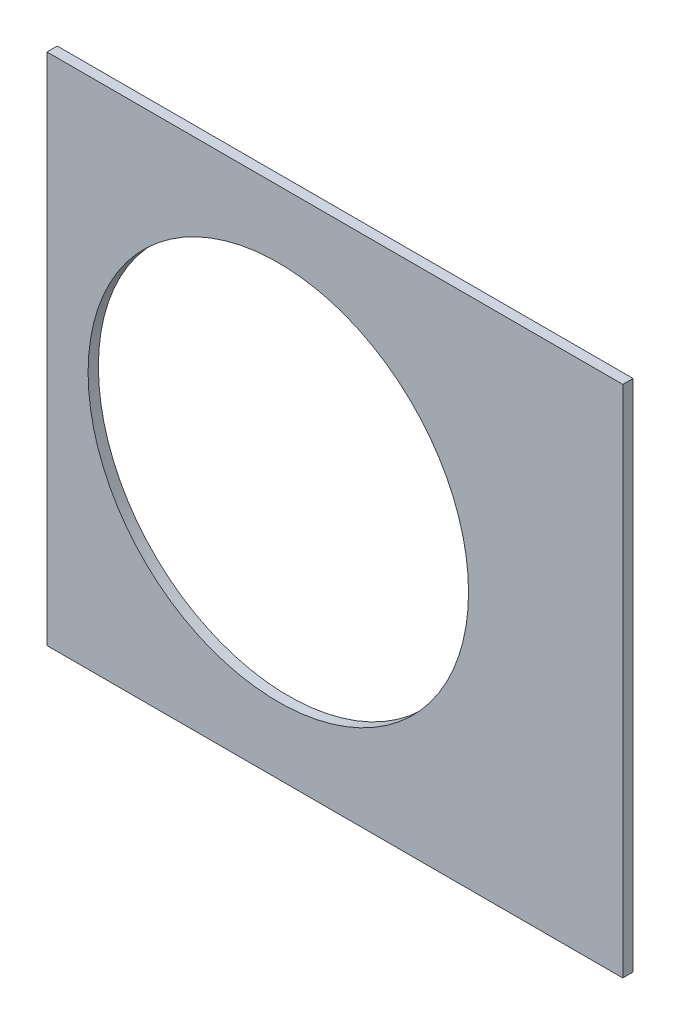
ISO-10303-21;
HEADER;
FILE_DESCRIPTION(('STEP AP214'),'2;1');
FILE_NAME('part.step','',(''),(''),'','','');
FILE_SCHEMA(('AUTOMOTIVE_DESIGN { 1 0 10303 214 1 1 1 1 }'));
ENDSEC;
DATA;
#1=APPLICATION_CONTEXT('core data for automotive mechanical design processes');
#2=APPLICATION_PROTOCOL_DEFINITION('international standard','automotive_design',2000,#1);
#3=PRODUCT_CONTEXT('',#1,'mechanical');
#4=PRODUCT('Part','Part','',(#3));
#5=PRODUCT_RELATED_PRODUCT_CATEGORY('part','',(#4));
#6=PRODUCT_DEFINITION_FORMATION('','',#4);
#7=PRODUCT_DEFINITION_CONTEXT('part definition',#1,'design');
#8=PRODUCT_DEFINITION('design','',#6,#7);
#9=PRODUCT_DEFINITION_SHAPE('','',#8);
#10=(LENGTH_UNIT() NAMED_UNIT(*) SI_UNIT(.MILLI.,.METRE.));
#11=(NAMED_UNIT(*) PLANE_ANGLE_UNIT() SI_UNIT($,.RADIAN.));
#12=(NAMED_UNIT(*) SI_UNIT($,.STERADIAN.) SOLID_ANGLE_UNIT());
#13=UNCERTAINTY_MEASURE_WITH_UNIT(LENGTH_MEASURE(1.E-05),#10,'distance_accuracy_value','');
#14=(GEOMETRIC_REPRESENTATION_CONTEXT(3) GLOBAL_UNCERTAINTY_ASSIGNED_CONTEXT((#13)) GLOBAL_UNIT_ASSIGNED_CONTEXT((#10,
#11,#12)) REPRESENTATION_CONTEXT('',''));
#15=CARTESIAN_POINT('',(0.,0.,0.));
#16=DIRECTION('',(0.,0.,1.));
#17=DIRECTION('',(1.,0.,0.));
#18=AXIS2_PLACEMENT_3D('',#15,#16,#17);
#19=CARTESIAN_POINT('',(0.,0.,0.254));
#20=DIRECTION('',(0.,0.,-1.));
#21=DIRECTION('',(-1.,0.,0.));
#22=AXIS2_PLACEMENT_3D('',#19,#20,#21);
#23=PLANE('',#22);
#24=CARTESIAN_POINT('',(75.692,0.,0.254));
#25=DIRECTION('',(0.,0.,1.));
#26=DIRECTION('',(1.,0.,0.));
#27=AXIS2_PLACEMENT_3D('',#24,#25,#26);
#28=CIRCLE('',#27,4.69899999999999);
#29=CARTESIAN_POINT('',(80.391,0.,0.254));
#30=VERTEX_POINT('',#29);
#31=EDGE_CURVE('E97',#30,#30,#28,.T.);
#32=ORIENTED_EDGE('',*,*,#31,.F.);
#33=EDGE_LOOP('',(#32));
#34=FACE_BOUND('',#33,.T.);
#35=DIRECTION('',(1.,0.,0.));
#36=VECTOR('',#35,1.);
#37=CARTESIAN_POINT('',(88.6729242779328,6.35,0.254));
#38=LINE('',#37,#36);
#39=CARTESIAN_POINT('',(69.977,6.35,0.254));
#40=VERTEX_POINT('',#39);
#41=CARTESIAN_POINT('',(84.201,6.35,0.254));
#42=VERTEX_POINT('',#41);
#43=EDGE_CURVE('E85',#40,#42,#38,.T.);
#44=ORIENTED_EDGE('',*,*,#43,.F.);
#45=DIRECTION('',(0.,1.,0.));
#46=VECTOR('',#45,1.);
#47=CARTESIAN_POINT('',(69.977,-6.35000000000001,0.254));
#48=LINE('',#47,#46);
#49=CARTESIAN_POINT('',(69.977,-6.35000000000001,0.254));
#50=VERTEX_POINT('',#49);
#51=EDGE_CURVE('E71',#50,#40,#48,.T.);
#52=ORIENTED_EDGE('',*,*,#51,.F.);
#53=DIRECTION('',(1.,0.,0.));
#54=VECTOR('',#53,1.);
#55=CARTESIAN_POINT('',(101.401368333963,-6.35,0.254));
#56=LINE('',#55,#54);
#57=CARTESIAN_POINT('',(84.201,-6.35000000000001,0.254));
#58=VERTEX_POINT('',#57);
#59=EDGE_CURVE('E12',#50,#58,#56,.T.);
#60=ORIENTED_EDGE('',*,*,#59,.T.);
#61=DIRECTION('',(0.,-1.,0.));
#62=VECTOR('',#61,1.);
#63=CARTESIAN_POINT('',(84.201,-6.35000000000001,0.254));
#64=LINE('',#63,#62);
#65=EDGE_CURVE('E88',#42,#58,#64,.T.);
#66=ORIENTED_EDGE('',*,*,#65,.F.);
#67=EDGE_LOOP('',(#44,#52,#60,#66));
#68=FACE_BOUND('',#67,.T.);
#69=ADVANCED_FACE('F35',(#34,#68),#23,.F.);
#70=CARTESIAN_POINT('',(0.,0.,0.));
#71=DIRECTION('',(0.,0.,-1.));
#72=DIRECTION('',(-1.,0.,0.));
#73=AXIS2_PLACEMENT_3D('',#70,#71,#72);
#74=PLANE('',#73);
#75=CARTESIAN_POINT('',(75.692,0.,0.));
#76=DIRECTION('',(0.,0.,1.));
#77=DIRECTION('',(1.,0.,0.));
#78=AXIS2_PLACEMENT_3D('',#75,#76,#77);
#79=CIRCLE('',#78,4.69899999999999);
#80=CARTESIAN_POINT('',(80.391,0.,0.));
#81=VERTEX_POINT('',#80);
#82=EDGE_CURVE('E94',#81,#81,#79,.T.);
#83=ORIENTED_EDGE('',*,*,#82,.T.);
#84=EDGE_LOOP('',(#83));
#85=FACE_BOUND('',#84,.T.);
#86=DIRECTION('',(0.,1.,0.));
#87=VECTOR('',#86,1.);
#88=CARTESIAN_POINT('',(69.977,-6.35000000000001,0.));
#89=LINE('',#88,#87);
#90=CARTESIAN_POINT('',(69.977,-6.35,0.));
#91=VERTEX_POINT('',#90);
#92=CARTESIAN_POINT('',(69.977,6.35,0.));
#93=VERTEX_POINT('',#92);
#94=EDGE_CURVE('E50',#91,#93,#89,.T.);
#95=ORIENTED_EDGE('',*,*,#94,.T.);
#96=DIRECTION('',(1.,0.,0.));
#97=VECTOR('',#96,1.);
#98=CARTESIAN_POINT('',(88.6729242779328,6.35,0.));
#99=LINE('',#98,#97);
#100=CARTESIAN_POINT('',(84.201,6.35,0.));
#101=VERTEX_POINT('',#100);
#102=EDGE_CURVE('E87',#93,#101,#99,.T.);
#103=ORIENTED_EDGE('',*,*,#102,.T.);
#104=DIRECTION('',(0.,-1.,0.));
#105=VECTOR('',#104,1.);
#106=CARTESIAN_POINT('',(84.201,-6.35000000000001,0.));
#107=LINE('',#106,#105);
#108=CARTESIAN_POINT('',(84.201,-6.35000000000001,0.));
#109=VERTEX_POINT('',#108);
#110=EDGE_CURVE('E106',#101,#109,#107,.T.);
#111=ORIENTED_EDGE('',*,*,#110,.T.);
#112=DIRECTION('',(1.,0.,0.));
#113=VECTOR('',#112,1.);
#114=CARTESIAN_POINT('',(101.401368333963,-6.35,0.));
#115=LINE('',#114,#113);
#116=EDGE_CURVE('E39',#91,#109,#115,.T.);
#117=ORIENTED_EDGE('',*,*,#116,.F.);
#118=EDGE_LOOP('',(#95,#103,#111,#117));
#119=FACE_BOUND('',#118,.T.);
#120=ADVANCED_FACE('F112',(#85,#119),#74,.T.);
#121=CARTESIAN_POINT('',(88.6729242779328,6.35,0.254));
#122=DIRECTION('',(0.,1.,0.));
#123=DIRECTION('',(-1.,0.,0.));
#124=AXIS2_PLACEMENT_3D('',#121,#122,#123);
#125=PLANE('',#124);
#126=ORIENTED_EDGE('',*,*,#102,.F.);
#127=DIRECTION('',(0.,0.,1.));
#128=VECTOR('',#127,1.);
#129=CARTESIAN_POINT('',(69.977,6.35,0.254));
#130=LINE('',#129,#128);
#131=EDGE_CURVE('E74',#93,#40,#130,.T.);
#132=ORIENTED_EDGE('',*,*,#131,.T.);
#133=ORIENTED_EDGE('',*,*,#43,.T.);
#134=DIRECTION('',(0.,0.,-1.));
#135=VECTOR('',#134,1.);
#136=CARTESIAN_POINT('',(84.201,6.35,0.254));
#137=LINE('',#136,#135);
#138=EDGE_CURVE('E89',#42,#101,#137,.T.);
#139=ORIENTED_EDGE('',*,*,#138,.T.);
#140=EDGE_LOOP('',(#126,#132,#133,#139));
#141=FACE_BOUND('',#140,.T.);
#142=ADVANCED_FACE('F83',(#141),#125,.T.);
#143=CARTESIAN_POINT('',(101.401368333963,-6.35,0.254));
#144=DIRECTION('',(0.,1.,0.));
#145=DIRECTION('',(-1.,0.,0.));
#146=AXIS2_PLACEMENT_3D('',#143,#144,#145);
#147=PLANE('',#146);
#148=ORIENTED_EDGE('',*,*,#116,.T.);
#149=DIRECTION('',(0.,0.,1.));
#150=VECTOR('',#149,1.);
#151=CARTESIAN_POINT('',(84.201,-6.35000000000001,0.));
#152=LINE('',#151,#150);
#153=EDGE_CURVE('E79',#109,#58,#152,.T.);
#154=ORIENTED_EDGE('',*,*,#153,.T.);
#155=ORIENTED_EDGE('',*,*,#59,.F.);
#156=DIRECTION('',(0.,0.,1.));
#157=VECTOR('',#156,1.);
#158=CARTESIAN_POINT('',(69.977,-6.35000000000001,0.));
#159=LINE('',#158,#157);
#160=EDGE_CURVE('E54',#91,#50,#159,.T.);
#161=ORIENTED_EDGE('',*,*,#160,.F.);
#162=EDGE_LOOP('',(#148,#154,#155,#161));
#163=FACE_BOUND('',#162,.T.);
#164=ADVANCED_FACE('F37',(#163),#147,.F.);
#165=CARTESIAN_POINT('',(75.692,0.,0.));
#166=DIRECTION('',(0.,0.,1.));
#167=DIRECTION('',(1.,0.,0.));
#168=AXIS2_PLACEMENT_3D('',#165,#166,#167);
#169=CYLINDRICAL_SURFACE('',#168,4.69899999999999);
#170=ORIENTED_EDGE('',*,*,#82,.F.);
#171=EDGE_LOOP('',(#170));
#172=FACE_BOUND('',#171,.T.);
#173=ORIENTED_EDGE('',*,*,#31,.T.);
#174=EDGE_LOOP('',(#173));
#175=FACE_BOUND('',#174,.T.);
#176=ADVANCED_FACE('F121',(#172,#175),#169,.F.);
#177=CARTESIAN_POINT('',(69.977,-6.35000000000001,0.));
#178=DIRECTION('',(1.,0.,0.));
#179=DIRECTION('',(0.,0.,-1.));
#180=AXIS2_PLACEMENT_3D('',#177,#178,#179);
#181=PLANE('',#180);
#182=ORIENTED_EDGE('',*,*,#51,.T.);
#183=ORIENTED_EDGE('',*,*,#131,.F.);
#184=ORIENTED_EDGE('',*,*,#94,.F.);
#185=ORIENTED_EDGE('',*,*,#160,.T.);
#186=EDGE_LOOP('',(#182,#183,#184,#185));
#187=FACE_BOUND('',#186,.T.);
#188=ADVANCED_FACE('F73',(#187),#181,.F.);
#189=CARTESIAN_POINT('',(84.201,-6.35000000000001,0.));
#190=DIRECTION('',(-1.,0.,0.));
#191=DIRECTION('',(0.,0.,1.));
#192=AXIS2_PLACEMENT_3D('',#189,#190,#191);
#193=PLANE('',#192);
#194=ORIENTED_EDGE('',*,*,#65,.T.);
#195=ORIENTED_EDGE('',*,*,#153,.F.);
#196=ORIENTED_EDGE('',*,*,#110,.F.);
#197=ORIENTED_EDGE('',*,*,#138,.F.);
#198=EDGE_LOOP('',(#194,#195,#196,#197));
#199=FACE_BOUND('',#198,.T.);
#200=ADVANCED_FACE('F115',(#199),#193,.F.);
#201=CLOSED_SHELL('',(#69,#120,#142,#164,#176,#188,#200));
#202=MANIFOLD_SOLID_BREP('B2',#201);
#203=ADVANCED_BREP_SHAPE_REPRESENTATION('',(#18,#202),#14);
#204=SHAPE_DEFINITION_REPRESENTATION(#9,#203);
ENDSEC;
END-ISO-10303-21;
